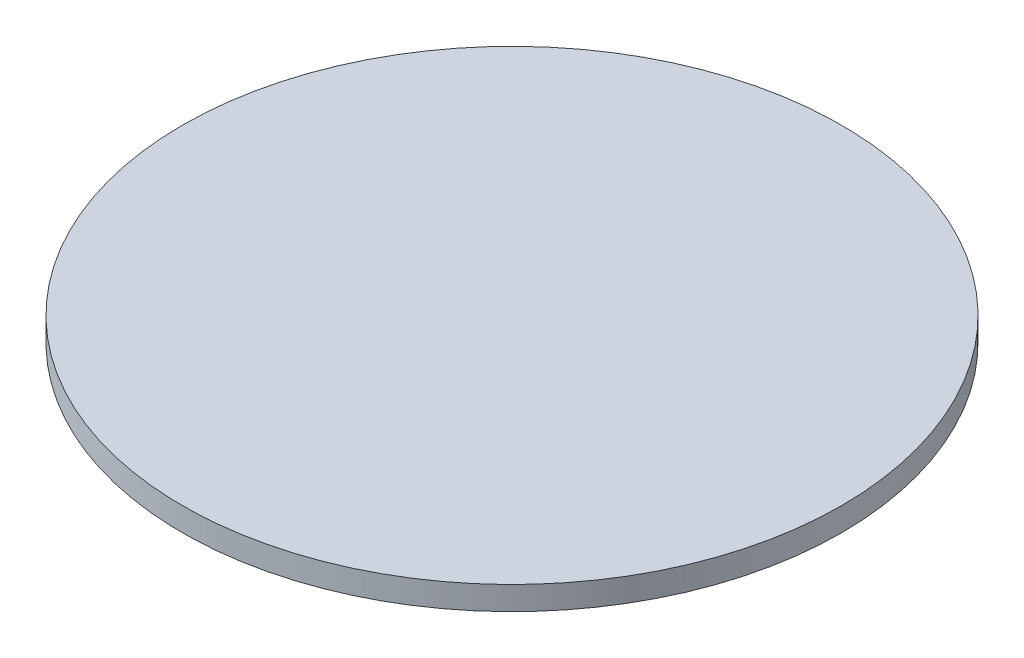
ISO-10303-21;
HEADER;
FILE_DESCRIPTION(('STEP AP214'),'2;1');
FILE_NAME('part.step','',(''),(''),'','','');
FILE_SCHEMA(('AUTOMOTIVE_DESIGN { 1 0 10303 214 1 1 1 1 }'));
ENDSEC;
DATA;
#1=APPLICATION_CONTEXT('core data for automotive mechanical design processes');
#2=APPLICATION_PROTOCOL_DEFINITION('international standard','automotive_design',2000,#1);
#3=PRODUCT_CONTEXT('',#1,'mechanical');
#4=PRODUCT('Part','Part','',(#3));
#5=PRODUCT_RELATED_PRODUCT_CATEGORY('part','',(#4));
#6=PRODUCT_DEFINITION_FORMATION('','',#4);
#7=PRODUCT_DEFINITION_CONTEXT('part definition',#1,'design');
#8=PRODUCT_DEFINITION('design','',#6,#7);
#9=PRODUCT_DEFINITION_SHAPE('','',#8);
#10=(LENGTH_UNIT() NAMED_UNIT(*) SI_UNIT(.MILLI.,.METRE.));
#11=(NAMED_UNIT(*) PLANE_ANGLE_UNIT() SI_UNIT($,.RADIAN.));
#12=(NAMED_UNIT(*) SI_UNIT($,.STERADIAN.) SOLID_ANGLE_UNIT());
#13=UNCERTAINTY_MEASURE_WITH_UNIT(LENGTH_MEASURE(1.E-05),#10,'distance_accuracy_value','');
#14=(GEOMETRIC_REPRESENTATION_CONTEXT(3) GLOBAL_UNCERTAINTY_ASSIGNED_CONTEXT((#13)) GLOBAL_UNIT_ASSIGNED_CONTEXT((#10,
#11,#12)) REPRESENTATION_CONTEXT('',''));
#15=CARTESIAN_POINT('',(0.,0.,0.));
#16=DIRECTION('',(0.,0.,1.));
#17=DIRECTION('',(1.,0.,0.));
#18=AXIS2_PLACEMENT_3D('',#15,#16,#17);
#19=CARTESIAN_POINT('',(0.,1.,0.));
#20=DIRECTION('',(0.,1.,0.));
#21=DIRECTION('',(-1.,0.,0.));
#22=AXIS2_PLACEMENT_3D('',#19,#20,#21);
#23=PLANE('',#22);
#24=CARTESIAN_POINT('',(0.,0.999999999999999,0.));
#25=DIRECTION('',(0.,-1.,0.));
#26=DIRECTION('',(1.,0.,0.));
#27=AXIS2_PLACEMENT_3D('',#24,#25,#26);
#28=CIRCLE('',#27,14.);
#29=CARTESIAN_POINT('',(14.,1.,0.));
#30=VERTEX_POINT('',#29);
#31=EDGE_CURVE('E10',#30,#30,#28,.T.);
#32=ORIENTED_EDGE('',*,*,#31,.F.);
#33=EDGE_LOOP('',(#32));
#34=FACE_BOUND('',#33,.T.);
#35=ADVANCED_FACE('F28',(#34),#23,.T.);
#36=CARTESIAN_POINT('',(0.,0.,0.));
#37=DIRECTION('',(0.,-1.,0.));
#38=DIRECTION('',(1.,0.,0.));
#39=AXIS2_PLACEMENT_3D('',#36,#37,#38);
#40=CYLINDRICAL_SURFACE('',#39,14.);
#41=ORIENTED_EDGE('',*,*,#31,.T.);
#42=EDGE_LOOP('',(#41));
#43=FACE_BOUND('',#42,.T.);
#44=CARTESIAN_POINT('',(0.,0.,0.));
#45=DIRECTION('',(0.,-1.,0.));
#46=DIRECTION('',(1.,0.,0.));
#47=AXIS2_PLACEMENT_3D('',#44,#45,#46);
#48=CIRCLE('',#47,14.);
#49=CARTESIAN_POINT('',(14.,0.,0.));
#50=VERTEX_POINT('',#49);
#51=EDGE_CURVE('E34',#50,#50,#48,.T.);
#52=ORIENTED_EDGE('',*,*,#51,.F.);
#53=EDGE_LOOP('',(#52));
#54=FACE_BOUND('',#53,.T.);
#55=ADVANCED_FACE('F60',(#43,#54),#40,.T.);
#56=CARTESIAN_POINT('',(14.,0.,0.));
#57=DIRECTION('',(0.,-1.,0.));
#58=DIRECTION('',(1.,0.,0.));
#59=AXIS2_PLACEMENT_3D('',#56,#57,#58);
#60=PLANE('',#59);
#61=ORIENTED_EDGE('',*,*,#51,.T.);
#62=EDGE_LOOP('',(#61));
#63=FACE_BOUND('',#62,.T.);
#64=CARTESIAN_POINT('',(0.,0.,0.));
#65=DIRECTION('',(0.,-1.,0.));
#66=DIRECTION('',(1.,0.,0.));
#67=AXIS2_PLACEMENT_3D('',#64,#65,#66);
#68=CIRCLE('',#67,13.5);
#69=CARTESIAN_POINT('',(13.5,0.,0.));
#70=VERTEX_POINT('',#69);
#71=EDGE_CURVE('E38',#70,#70,#68,.T.);
#72=ORIENTED_EDGE('',*,*,#71,.F.);
#73=EDGE_LOOP('',(#72));
#74=FACE_BOUND('',#73,.T.);
#75=ADVANCED_FACE('F52',(#63,#74),#60,.T.);
#76=CARTESIAN_POINT('',(0.,0.,0.));
#77=DIRECTION('',(0.,-1.,0.));
#78=DIRECTION('',(1.,0.,0.));
#79=AXIS2_PLACEMENT_3D('',#76,#77,#78);
#80=CYLINDRICAL_SURFACE('',#79,13.5);
#81=ORIENTED_EDGE('',*,*,#71,.T.);
#82=EDGE_LOOP('',(#81));
#83=FACE_BOUND('',#82,.T.);
#84=CARTESIAN_POINT('',(0.,0.7,0.));
#85=DIRECTION('',(0.,-1.,0.));
#86=DIRECTION('',(1.,0.,0.));
#87=AXIS2_PLACEMENT_3D('',#84,#85,#86);
#88=CIRCLE('',#87,13.5);
#89=CARTESIAN_POINT('',(13.5,0.7,0.));
#90=VERTEX_POINT('',#89);
#91=EDGE_CURVE('E42',#90,#90,#88,.T.);
#92=ORIENTED_EDGE('',*,*,#91,.F.);
#93=EDGE_LOOP('',(#92));
#94=FACE_BOUND('',#93,.T.);
#95=ADVANCED_FACE('F50',(#83,#94),#80,.F.);
#96=CARTESIAN_POINT('',(13.5,0.7,0.));
#97=DIRECTION('',(0.,-1.,0.));
#98=DIRECTION('',(1.,0.,0.));
#99=AXIS2_PLACEMENT_3D('',#96,#97,#98);
#100=PLANE('',#99);
#101=ORIENTED_EDGE('',*,*,#91,.T.);
#102=EDGE_LOOP('',(#101));
#103=FACE_BOUND('',#102,.T.);
#104=ADVANCED_FACE('F48',(#103),#100,.T.);
#105=CLOSED_SHELL('',(#35,#55,#75,#95,#104));
#106=MANIFOLD_SOLID_BREP('B2',#105);
#107=ADVANCED_BREP_SHAPE_REPRESENTATION('',(#18,#106),#14);
#108=SHAPE_DEFINITION_REPRESENTATION(#9,#107);
ENDSEC;
END-ISO-10303-21;
